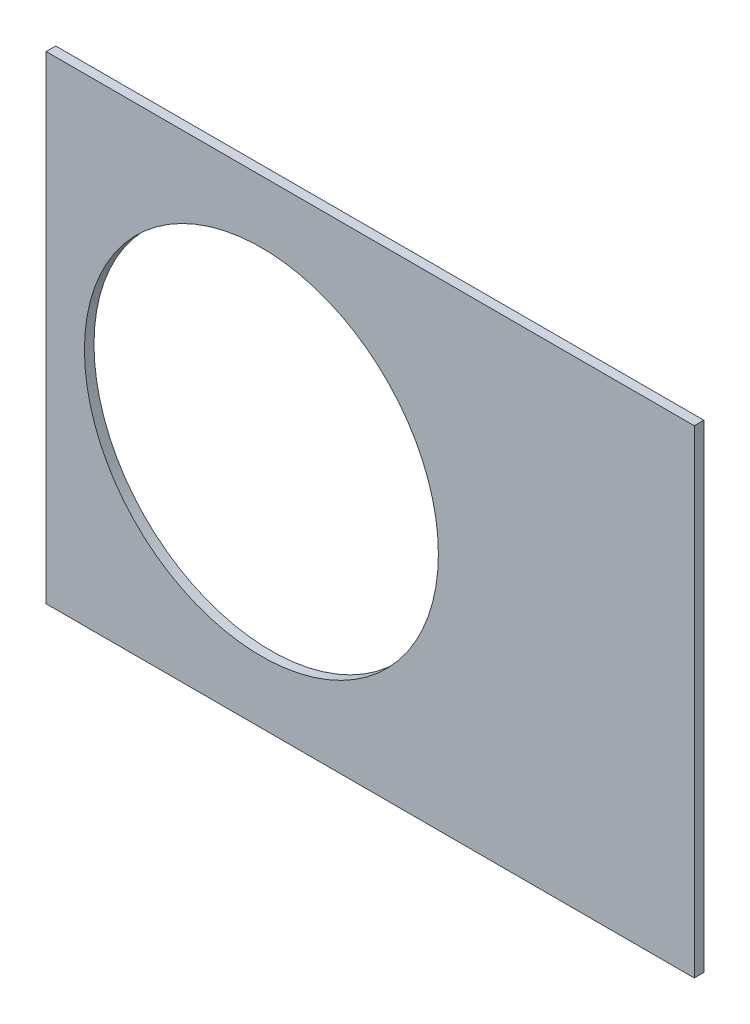
ISO-10303-21;
HEADER;
FILE_DESCRIPTION(('STEP AP214'),'2;1');
FILE_NAME('part.step','',(''),(''),'','','');
FILE_SCHEMA(('AUTOMOTIVE_DESIGN { 1 0 10303 214 1 1 1 1 }'));
ENDSEC;
DATA;
#1=APPLICATION_CONTEXT('core data for automotive mechanical design processes');
#2=APPLICATION_PROTOCOL_DEFINITION('international standard','automotive_design',2000,#1);
#3=PRODUCT_CONTEXT('',#1,'mechanical');
#4=PRODUCT('Part','Part','',(#3));
#5=PRODUCT_RELATED_PRODUCT_CATEGORY('part','',(#4));
#6=PRODUCT_DEFINITION_FORMATION('','',#4);
#7=PRODUCT_DEFINITION_CONTEXT('part definition',#1,'design');
#8=PRODUCT_DEFINITION('design','',#6,#7);
#9=PRODUCT_DEFINITION_SHAPE('','',#8);
#10=(LENGTH_UNIT() NAMED_UNIT(*) SI_UNIT(.MILLI.,.METRE.));
#11=(NAMED_UNIT(*) PLANE_ANGLE_UNIT() SI_UNIT($,.RADIAN.));
#12=(NAMED_UNIT(*) SI_UNIT($,.STERADIAN.) SOLID_ANGLE_UNIT());
#13=UNCERTAINTY_MEASURE_WITH_UNIT(LENGTH_MEASURE(1.E-05),#10,'distance_accuracy_value','');
#14=(GEOMETRIC_REPRESENTATION_CONTEXT(3) GLOBAL_UNCERTAINTY_ASSIGNED_CONTEXT((#13)) GLOBAL_UNIT_ASSIGNED_CONTEXT((#10,
#11,#12)) REPRESENTATION_CONTEXT('',''));
#15=CARTESIAN_POINT('',(0.,0.,0.));
#16=DIRECTION('',(0.,0.,1.));
#17=DIRECTION('',(1.,0.,0.));
#18=AXIS2_PLACEMENT_3D('',#15,#16,#17);
#19=CARTESIAN_POINT('',(0.,0.,0.254));
#20=DIRECTION('',(0.,0.,-1.));
#21=DIRECTION('',(-1.,0.,0.));
#22=AXIS2_PLACEMENT_3D('',#19,#20,#21);
#23=PLANE('',#22);
#24=CARTESIAN_POINT('',(36.195,0.,0.254));
#25=DIRECTION('',(0.,0.,1.));
#26=DIRECTION('',(1.,0.,0.));
#27=AXIS2_PLACEMENT_3D('',#24,#25,#26);
#28=CIRCLE('',#27,4.699);
#29=CARTESIAN_POINT('',(40.894,0.,0.254));
#30=VERTEX_POINT('',#29);
#31=EDGE_CURVE('E97',#30,#30,#28,.T.);
#32=ORIENTED_EDGE('',*,*,#31,.F.);
#33=EDGE_LOOP('',(#32));
#34=FACE_BOUND('',#33,.T.);
#35=DIRECTION('',(1.,0.,0.));
#36=VECTOR('',#35,1.);
#37=CARTESIAN_POINT('',(88.6729242779328,6.35,0.254));
#38=LINE('',#37,#36);
#39=CARTESIAN_POINT('',(30.48,6.34999999999999,0.254));
#40=VERTEX_POINT('',#39);
#41=CARTESIAN_POINT('',(47.6885,6.34999999999999,0.254));
#42=VERTEX_POINT('',#41);
#43=EDGE_CURVE('E85',#40,#42,#38,.T.);
#44=ORIENTED_EDGE('',*,*,#43,.F.);
#45=DIRECTION('',(0.,1.,0.));
#46=VECTOR('',#45,1.);
#47=CARTESIAN_POINT('',(30.48,-6.35000000000001,0.254));
#48=LINE('',#47,#46);
#49=CARTESIAN_POINT('',(30.48,-6.35000000000001,0.254));
#50=VERTEX_POINT('',#49);
#51=EDGE_CURVE('E71',#50,#40,#48,.T.);
#52=ORIENTED_EDGE('',*,*,#51,.F.);
#53=DIRECTION('',(1.,0.,0.));
#54=VECTOR('',#53,1.);
#55=CARTESIAN_POINT('',(101.401368333963,-6.35,0.254));
#56=LINE('',#55,#54);
#57=CARTESIAN_POINT('',(47.6885,-6.35000000000001,0.254));
#58=VERTEX_POINT('',#57);
#59=EDGE_CURVE('E12',#50,#58,#56,.T.);
#60=ORIENTED_EDGE('',*,*,#59,.T.);
#61=DIRECTION('',(0.,-1.,0.));
#62=VECTOR('',#61,1.);
#63=CARTESIAN_POINT('',(47.6885,-6.35000000000001,0.254));
#64=LINE('',#63,#62);
#65=EDGE_CURVE('E88',#42,#58,#64,.T.);
#66=ORIENTED_EDGE('',*,*,#65,.F.);
#67=EDGE_LOOP('',(#44,#52,#60,#66));
#68=FACE_BOUND('',#67,.T.);
#69=ADVANCED_FACE('F35',(#34,#68),#23,.F.);
#70=CARTESIAN_POINT('',(0.,0.,0.));
#71=DIRECTION('',(0.,0.,-1.));
#72=DIRECTION('',(-1.,0.,0.));
#73=AXIS2_PLACEMENT_3D('',#70,#71,#72);
#74=PLANE('',#73);
#75=CARTESIAN_POINT('',(36.195,0.,0.));
#76=DIRECTION('',(0.,0.,1.));
#77=DIRECTION('',(1.,0.,0.));
#78=AXIS2_PLACEMENT_3D('',#75,#76,#77);
#79=CIRCLE('',#78,4.699);
#80=CARTESIAN_POINT('',(40.894,0.,0.));
#81=VERTEX_POINT('',#80);
#82=EDGE_CURVE('E94',#81,#81,#79,.T.);
#83=ORIENTED_EDGE('',*,*,#82,.T.);
#84=EDGE_LOOP('',(#83));
#85=FACE_BOUND('',#84,.T.);
#86=DIRECTION('',(0.,1.,0.));
#87=VECTOR('',#86,1.);
#88=CARTESIAN_POINT('',(30.48,-6.35000000000001,0.));
#89=LINE('',#88,#87);
#90=CARTESIAN_POINT('',(30.48,-6.35000000000001,0.));
#91=VERTEX_POINT('',#90);
#92=CARTESIAN_POINT('',(30.48,6.34999999999999,0.));
#93=VERTEX_POINT('',#92);
#94=EDGE_CURVE('E50',#91,#93,#89,.T.);
#95=ORIENTED_EDGE('',*,*,#94,.T.);
#96=DIRECTION('',(1.,0.,0.));
#97=VECTOR('',#96,1.);
#98=CARTESIAN_POINT('',(88.6729242779328,6.35,0.));
#99=LINE('',#98,#97);
#100=CARTESIAN_POINT('',(47.6885,6.34999999999999,0.));
#101=VERTEX_POINT('',#100);
#102=EDGE_CURVE('E87',#93,#101,#99,.T.);
#103=ORIENTED_EDGE('',*,*,#102,.T.);
#104=DIRECTION('',(0.,-1.,0.));
#105=VECTOR('',#104,1.);
#106=CARTESIAN_POINT('',(47.6885,-6.35000000000001,0.));
#107=LINE('',#106,#105);
#108=CARTESIAN_POINT('',(47.6885,-6.35000000000001,0.));
#109=VERTEX_POINT('',#108);
#110=EDGE_CURVE('E106',#101,#109,#107,.T.);
#111=ORIENTED_EDGE('',*,*,#110,.T.);
#112=DIRECTION('',(1.,0.,0.));
#113=VECTOR('',#112,1.);
#114=CARTESIAN_POINT('',(101.401368333963,-6.35,0.));
#115=LINE('',#114,#113);
#116=EDGE_CURVE('E39',#91,#109,#115,.T.);
#117=ORIENTED_EDGE('',*,*,#116,.F.);
#118=EDGE_LOOP('',(#95,#103,#111,#117));
#119=FACE_BOUND('',#118,.T.);
#120=ADVANCED_FACE('F112',(#85,#119),#74,.T.);
#121=CARTESIAN_POINT('',(88.6729242779328,6.35,0.254));
#122=DIRECTION('',(0.,1.,0.));
#123=DIRECTION('',(-1.,0.,0.));
#124=AXIS2_PLACEMENT_3D('',#121,#122,#123);
#125=PLANE('',#124);
#126=ORIENTED_EDGE('',*,*,#102,.F.);
#127=DIRECTION('',(0.,0.,1.));
#128=VECTOR('',#127,1.);
#129=CARTESIAN_POINT('',(30.48,6.34999999999999,0.254));
#130=LINE('',#129,#128);
#131=EDGE_CURVE('E74',#93,#40,#130,.T.);
#132=ORIENTED_EDGE('',*,*,#131,.T.);
#133=ORIENTED_EDGE('',*,*,#43,.T.);
#134=DIRECTION('',(0.,0.,-1.));
#135=VECTOR('',#134,1.);
#136=CARTESIAN_POINT('',(47.6885,6.34999999999999,0.254));
#137=LINE('',#136,#135);
#138=EDGE_CURVE('E89',#42,#101,#137,.T.);
#139=ORIENTED_EDGE('',*,*,#138,.T.);
#140=EDGE_LOOP('',(#126,#132,#133,#139));
#141=FACE_BOUND('',#140,.T.);
#142=ADVANCED_FACE('F83',(#141),#125,.T.);
#143=CARTESIAN_POINT('',(101.401368333963,-6.35,0.254));
#144=DIRECTION('',(0.,1.,0.));
#145=DIRECTION('',(-1.,0.,0.));
#146=AXIS2_PLACEMENT_3D('',#143,#144,#145);
#147=PLANE('',#146);
#148=ORIENTED_EDGE('',*,*,#116,.T.);
#149=DIRECTION('',(0.,0.,1.));
#150=VECTOR('',#149,1.);
#151=CARTESIAN_POINT('',(47.6885,-6.35000000000001,0.));
#152=LINE('',#151,#150);
#153=EDGE_CURVE('E79',#109,#58,#152,.T.);
#154=ORIENTED_EDGE('',*,*,#153,.T.);
#155=ORIENTED_EDGE('',*,*,#59,.F.);
#156=DIRECTION('',(0.,0.,1.));
#157=VECTOR('',#156,1.);
#158=CARTESIAN_POINT('',(30.48,-6.35000000000001,0.));
#159=LINE('',#158,#157);
#160=EDGE_CURVE('E54',#91,#50,#159,.T.);
#161=ORIENTED_EDGE('',*,*,#160,.F.);
#162=EDGE_LOOP('',(#148,#154,#155,#161));
#163=FACE_BOUND('',#162,.T.);
#164=ADVANCED_FACE('F37',(#163),#147,.F.);
#165=CARTESIAN_POINT('',(36.195,0.,0.));
#166=DIRECTION('',(0.,0.,1.));
#167=DIRECTION('',(1.,0.,0.));
#168=AXIS2_PLACEMENT_3D('',#165,#166,#167);
#169=CYLINDRICAL_SURFACE('',#168,4.699);
#170=ORIENTED_EDGE('',*,*,#82,.F.);
#171=EDGE_LOOP('',(#170));
#172=FACE_BOUND('',#171,.T.);
#173=ORIENTED_EDGE('',*,*,#31,.T.);
#174=EDGE_LOOP('',(#173));
#175=FACE_BOUND('',#174,.T.);
#176=ADVANCED_FACE('F121',(#172,#175),#169,.F.);
#177=CARTESIAN_POINT('',(30.48,-6.35000000000001,0.));
#178=DIRECTION('',(1.,0.,0.));
#179=DIRECTION('',(0.,0.,-1.));
#180=AXIS2_PLACEMENT_3D('',#177,#178,#179);
#181=PLANE('',#180);
#182=ORIENTED_EDGE('',*,*,#51,.T.);
#183=ORIENTED_EDGE('',*,*,#131,.F.);
#184=ORIENTED_EDGE('',*,*,#94,.F.);
#185=ORIENTED_EDGE('',*,*,#160,.T.);
#186=EDGE_LOOP('',(#182,#183,#184,#185));
#187=FACE_BOUND('',#186,.T.);
#188=ADVANCED_FACE('F73',(#187),#181,.F.);
#189=CARTESIAN_POINT('',(47.6885,-6.35000000000001,0.));
#190=DIRECTION('',(-1.,0.,0.));
#191=DIRECTION('',(0.,0.,1.));
#192=AXIS2_PLACEMENT_3D('',#189,#190,#191);
#193=PLANE('',#192);
#194=ORIENTED_EDGE('',*,*,#65,.T.);
#195=ORIENTED_EDGE('',*,*,#153,.F.);
#196=ORIENTED_EDGE('',*,*,#110,.F.);
#197=ORIENTED_EDGE('',*,*,#138,.F.);
#198=EDGE_LOOP('',(#194,#195,#196,#197));
#199=FACE_BOUND('',#198,.T.);
#200=ADVANCED_FACE('F115',(#199),#193,.F.);
#201=CLOSED_SHELL('',(#69,#120,#142,#164,#176,#188,#200));
#202=MANIFOLD_SOLID_BREP('B2',#201);
#203=ADVANCED_BREP_SHAPE_REPRESENTATION('',(#18,#202),#14);
#204=SHAPE_DEFINITION_REPRESENTATION(#9,#203);
ENDSEC;
END-ISO-10303-21;
